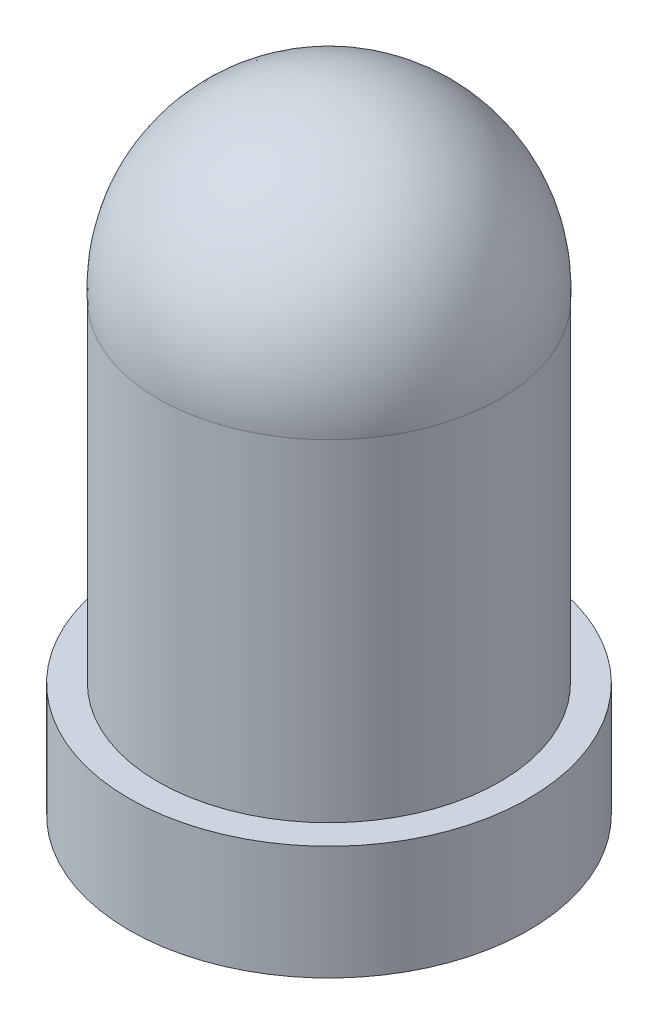
ISO-10303-21;
HEADER;
FILE_DESCRIPTION(('STEP AP214'),'2;1');
FILE_NAME('part.step','',(''),(''),'','','');
FILE_SCHEMA(('AUTOMOTIVE_DESIGN { 1 0 10303 214 1 1 1 1 }'));
ENDSEC;
DATA;
#1=APPLICATION_CONTEXT('core data for automotive mechanical design processes');
#2=APPLICATION_PROTOCOL_DEFINITION('international standard','automotive_design',2000,#1);
#3=PRODUCT_CONTEXT('',#1,'mechanical');
#4=PRODUCT('Part','Part','',(#3));
#5=PRODUCT_RELATED_PRODUCT_CATEGORY('part','',(#4));
#6=PRODUCT_DEFINITION_FORMATION('','',#4);
#7=PRODUCT_DEFINITION_CONTEXT('part definition',#1,'design');
#8=PRODUCT_DEFINITION('design','',#6,#7);
#9=PRODUCT_DEFINITION_SHAPE('','',#8);
#10=(LENGTH_UNIT() NAMED_UNIT(*) SI_UNIT(.MILLI.,.METRE.));
#11=(NAMED_UNIT(*) PLANE_ANGLE_UNIT() SI_UNIT($,.RADIAN.));
#12=(NAMED_UNIT(*) SI_UNIT($,.STERADIAN.) SOLID_ANGLE_UNIT());
#13=UNCERTAINTY_MEASURE_WITH_UNIT(LENGTH_MEASURE(1.E-05),#10,'distance_accuracy_value','');
#14=(GEOMETRIC_REPRESENTATION_CONTEXT(3) GLOBAL_UNCERTAINTY_ASSIGNED_CONTEXT((#13)) GLOBAL_UNIT_ASSIGNED_CONTEXT((#10,
#11,#12)) REPRESENTATION_CONTEXT('',''));
#15=CARTESIAN_POINT('',(0.,0.,0.));
#16=DIRECTION('',(0.,0.,1.));
#17=DIRECTION('',(1.,0.,0.));
#18=AXIS2_PLACEMENT_3D('',#15,#16,#17);
#19=CARTESIAN_POINT('',(-31.84259643367,3.947980609798,-24.1723307529));
#20=DIRECTION('',(0.,1.,0.));
#21=DIRECTION('',(0.,0.,1.));
#22=AXIS2_PLACEMENT_3D('',#19,#20,#21);
#23=PLANE('',#22);
#24=CARTESIAN_POINT('',(-30.09259643367,3.947980609798,-24.1723307529));
#25=DIRECTION('',(0.,1.,0.));
#26=DIRECTION('',(0.,0.,1.));
#27=AXIS2_PLACEMENT_3D('',#24,#25,#26);
#28=CIRCLE('',#27,1.75);
#29=CARTESIAN_POINT('',(-30.09259643367,3.947980609798,-22.4223307529));
#30=VERTEX_POINT('',#29);
#31=EDGE_CURVE('E20',#30,#30,#28,.T.);
#32=ORIENTED_EDGE('',*,*,#31,.F.);
#33=EDGE_LOOP('',(#32));
#34=FACE_BOUND('',#33,.T.);
#35=ADVANCED_FACE('F17',(#34),#23,.F.);
#36=CARTESIAN_POINT('',(-30.09259643367,3.947980609798,-24.1723307529));
#37=DIRECTION('',(0.,1.,0.));
#38=DIRECTION('',(0.,0.,1.));
#39=AXIS2_PLACEMENT_3D('',#36,#37,#38);
#40=CYLINDRICAL_SURFACE('',#39,1.75);
#41=ORIENTED_EDGE('',*,*,#31,.T.);
#42=EDGE_LOOP('',(#41));
#43=FACE_BOUND('',#42,.T.);
#44=CARTESIAN_POINT('',(-30.09259643367,4.947980609798,-24.1723307529));
#45=DIRECTION('',(0.,1.,0.));
#46=DIRECTION('',(0.,0.,1.));
#47=AXIS2_PLACEMENT_3D('',#44,#45,#46);
#48=CIRCLE('',#47,1.75);
#49=CARTESIAN_POINT('',(-30.09259643367,4.947980609798,-22.4223307529));
#50=VERTEX_POINT('',#49);
#51=EDGE_CURVE('E57',#50,#50,#48,.F.);
#52=ORIENTED_EDGE('',*,*,#51,.T.);
#53=EDGE_LOOP('',(#52));
#54=FACE_BOUND('',#53,.T.);
#55=ADVANCED_FACE('F35',(#43,#54),#40,.T.);
#56=CARTESIAN_POINT('',(-30.09259643367,7.947980609798,-24.1723307529));
#57=DIRECTION('',(-1.,0.,0.));
#58=DIRECTION('',(0.,1.,0.));
#59=AXIS2_PLACEMENT_3D('',#56,#57,#58);
#60=SPHERICAL_SURFACE('',#59,1.5);
#61=CARTESIAN_POINT('',(-31.59259643367,7.947980609798,-24.1723307529));
#62=VERTEX_POINT('',#61);
#63=VERTEX_LOOP('',#62);
#64=FACE_BOUND('',#63,.T.);
#65=CARTESIAN_POINT('',(-30.09259643367,7.85465607383,-24.1723307529));
#66=DIRECTION('',(0.,1.,0.));
#67=DIRECTION('',(0.,0.,1.));
#68=AXIS2_PLACEMENT_3D('',#65,#66,#67);
#69=CIRCLE('',#68,1.497094028773);
#70=CARTESIAN_POINT('',(-30.09259643367,7.85465607383,-22.675236724127));
#71=VERTEX_POINT('',#70);
#72=EDGE_CURVE('E26',#71,#71,#69,.F.);
#73=ORIENTED_EDGE('',*,*,#72,.F.);
#74=EDGE_LOOP('',(#73));
#75=FACE_BOUND('',#74,.T.);
#76=CARTESIAN_POINT('',(-28.59259643367,7.947980609798,-24.1723307529));
#77=VERTEX_POINT('',#76);
#78=VERTEX_LOOP('',#77);
#79=FACE_BOUND('',#78,.T.);
#80=ADVANCED_FACE('F32',(#64,#75,#79),#60,.T.);
#81=CARTESIAN_POINT('',(-31.58969046244,4.947980609798,-24.1723307529));
#82=DIRECTION('',(0.,-1.,0.));
#83=DIRECTION('',(0.,0.,-1.));
#84=AXIS2_PLACEMENT_3D('',#81,#82,#83);
#85=PLANE('',#84);
#86=CARTESIAN_POINT('',(-30.09259643367,4.947980609798,-24.1723307529));
#87=DIRECTION('',(0.,1.,0.));
#88=DIRECTION('',(0.,0.,1.));
#89=AXIS2_PLACEMENT_3D('',#86,#87,#88);
#90=CIRCLE('',#89,1.497094028773);
#91=CARTESIAN_POINT('',(-30.09259643367,4.947980609798,-22.675236724127));
#92=VERTEX_POINT('',#91);
#93=EDGE_CURVE('E11',#92,#92,#90,.T.);
#94=ORIENTED_EDGE('',*,*,#93,.F.);
#95=EDGE_LOOP('',(#94));
#96=FACE_BOUND('',#95,.T.);
#97=ORIENTED_EDGE('',*,*,#51,.F.);
#98=EDGE_LOOP('',(#97));
#99=FACE_BOUND('',#98,.T.);
#100=ADVANCED_FACE('F34',(#96,#99),#85,.F.);
#101=CARTESIAN_POINT('',(-30.09259643367,3.947980609798,-24.1723307529));
#102=DIRECTION('',(0.,1.,0.));
#103=DIRECTION('',(0.,0.,1.));
#104=AXIS2_PLACEMENT_3D('',#101,#102,#103);
#105=CYLINDRICAL_SURFACE('',#104,1.497094028773);
#106=ORIENTED_EDGE('',*,*,#93,.T.);
#107=EDGE_LOOP('',(#106));
#108=FACE_BOUND('',#107,.T.);
#109=ORIENTED_EDGE('',*,*,#72,.T.);
#110=EDGE_LOOP('',(#109));
#111=FACE_BOUND('',#110,.T.);
#112=ADVANCED_FACE('F42',(#108,#111),#105,.T.);
#113=CLOSED_SHELL('',(#35,#55,#80,#100,#112));
#114=MANIFOLD_SOLID_BREP('B1',#113);
#115=ADVANCED_BREP_SHAPE_REPRESENTATION('',(#18,#114),#14);
#116=SHAPE_DEFINITION_REPRESENTATION(#9,#115);
ENDSEC;
END-ISO-10303-21;
